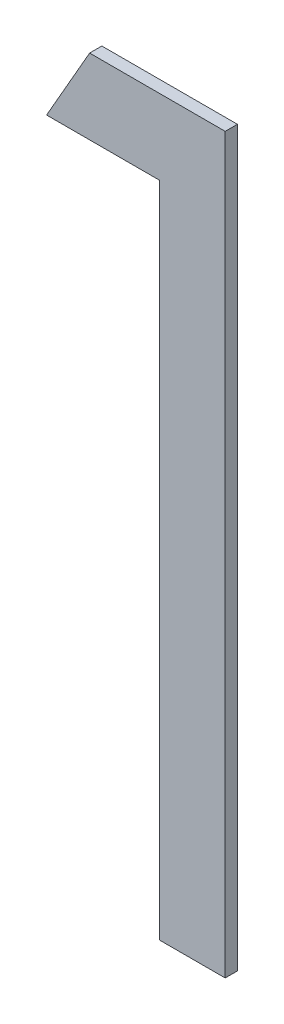
ISO-10303-21;
HEADER;
FILE_DESCRIPTION(('STEP AP214'),'2;1');
FILE_NAME('part.step','',(''),(''),'','','');
FILE_SCHEMA(('AUTOMOTIVE_DESIGN { 1 0 10303 214 1 1 1 1 }'));
ENDSEC;
DATA;
#1=APPLICATION_CONTEXT('core data for automotive mechanical design processes');
#2=APPLICATION_PROTOCOL_DEFINITION('international standard','automotive_design',2000,#1);
#3=PRODUCT_CONTEXT('',#1,'mechanical');
#4=PRODUCT('Part','Part','',(#3));
#5=PRODUCT_RELATED_PRODUCT_CATEGORY('part','',(#4));
#6=PRODUCT_DEFINITION_FORMATION('','',#4);
#7=PRODUCT_DEFINITION_CONTEXT('part definition',#1,'design');
#8=PRODUCT_DEFINITION('design','',#6,#7);
#9=PRODUCT_DEFINITION_SHAPE('','',#8);
#10=(LENGTH_UNIT() NAMED_UNIT(*) SI_UNIT(.MILLI.,.METRE.));
#11=(NAMED_UNIT(*) PLANE_ANGLE_UNIT() SI_UNIT($,.RADIAN.));
#12=(NAMED_UNIT(*) SI_UNIT($,.STERADIAN.) SOLID_ANGLE_UNIT());
#13=UNCERTAINTY_MEASURE_WITH_UNIT(LENGTH_MEASURE(1.E-05),#10,'distance_accuracy_value','');
#14=(GEOMETRIC_REPRESENTATION_CONTEXT(3) GLOBAL_UNCERTAINTY_ASSIGNED_CONTEXT((#13)) GLOBAL_UNIT_ASSIGNED_CONTEXT((#10,
#11,#12)) REPRESENTATION_CONTEXT('',''));
#15=CARTESIAN_POINT('',(0.,0.,0.));
#16=DIRECTION('',(0.,0.,1.));
#17=DIRECTION('',(1.,0.,0.));
#18=AXIS2_PLACEMENT_3D('',#15,#16,#17);
#19=CARTESIAN_POINT('',(0.361363980490763,1.06273011000654,0.551));
#20=DIRECTION('',(-0.867930013859703,0.496686511837693,0.));
#21=DIRECTION('',(-0.496686511837693,-0.867930013859703,0.));
#22=AXIS2_PLACEMENT_3D('',#19,#20,#21);
#23=PLANE('',#22);
#24=DIRECTION('',(0.496686511837698,0.867930013859701,0.));
#25=VECTOR('',#24,1.);
#26=CARTESIAN_POINT('',(0.361363980490763,1.06273011000654,0.55));
#27=LINE('',#26,#25);
#28=CARTESIAN_POINT('',(0.361363980490763,1.06273011000654,0.55));
#29=VERTEX_POINT('',#28);
#30=CARTESIAN_POINT('',(0.364885615106147,1.06888395616039,0.55));
#31=VERTEX_POINT('',#30);
#32=EDGE_CURVE('E11',#29,#31,#27,.T.);
#33=ORIENTED_EDGE('',*,*,#32,.F.);
#34=DIRECTION('',(0.,-2.22044604925006E-13,-1.));
#35=VECTOR('',#34,1.);
#36=CARTESIAN_POINT('',(0.361363980490763,1.06273011000654,0.551));
#37=LINE('',#36,#35);
#38=CARTESIAN_POINT('',(0.361363980490763,1.06273011000654,0.551));
#39=VERTEX_POINT('',#38);
#40=EDGE_CURVE('E119',#39,#29,#37,.T.);
#41=ORIENTED_EDGE('',*,*,#40,.F.);
#42=DIRECTION('',(0.496686511837698,0.867930013859701,0.));
#43=VECTOR('',#42,1.);
#44=CARTESIAN_POINT('',(0.361363980490763,1.06273011000654,0.551));
#45=LINE('',#44,#43);
#46=CARTESIAN_POINT('',(0.364885615106147,1.06888395616039,0.551));
#47=VERTEX_POINT('',#46);
#48=EDGE_CURVE('E112',#39,#47,#45,.T.);
#49=ORIENTED_EDGE('',*,*,#48,.T.);
#50=DIRECTION('',(0.,0.,-1.));
#51=VECTOR('',#50,1.);
#52=CARTESIAN_POINT('',(0.364885615106147,1.06888395616039,0.551));
#53=LINE('',#52,#51);
#54=EDGE_CURVE('E85',#47,#31,#53,.T.);
#55=ORIENTED_EDGE('',*,*,#54,.T.);
#56=EDGE_LOOP('',(#33,#41,#49,#55));
#57=FACE_BOUND('',#56,.T.);
#58=ADVANCED_FACE('F17',(#57),#23,.T.);
#59=CARTESIAN_POINT('',(0.370594749721532,1.06273011000654,0.551));
#60=DIRECTION('',(0.,-1.,0.));
#61=DIRECTION('',(0.,0.,-1.));
#62=AXIS2_PLACEMENT_3D('',#59,#60,#61);
#63=PLANE('',#62);
#64=DIRECTION('',(-1.,0.,0.));
#65=VECTOR('',#64,1.);
#66=CARTESIAN_POINT('',(0.370594749721532,1.06273011000654,0.55));
#67=LINE('',#66,#65);
#68=CARTESIAN_POINT('',(0.370594749721532,1.06273011000654,0.55));
#69=VERTEX_POINT('',#68);
#70=EDGE_CURVE('E24',#69,#29,#67,.T.);
#71=ORIENTED_EDGE('',*,*,#70,.F.);
#72=DIRECTION('',(0.,-2.22044604925006E-13,-1.));
#73=VECTOR('',#72,1.);
#74=CARTESIAN_POINT('',(0.370594749721532,1.06273011000654,0.551));
#75=LINE('',#74,#73);
#76=CARTESIAN_POINT('',(0.370594749721532,1.06273011000654,0.551));
#77=VERTEX_POINT('',#76);
#78=EDGE_CURVE('E114',#77,#69,#75,.T.);
#79=ORIENTED_EDGE('',*,*,#78,.F.);
#80=DIRECTION('',(-1.,0.,0.));
#81=VECTOR('',#80,1.);
#82=CARTESIAN_POINT('',(0.370594749721532,1.06273011000654,0.551));
#83=LINE('',#82,#81);
#84=EDGE_CURVE('E103',#77,#39,#83,.T.);
#85=ORIENTED_EDGE('',*,*,#84,.T.);
#86=ORIENTED_EDGE('',*,*,#40,.T.);
#87=EDGE_LOOP('',(#71,#79,#85,#86));
#88=FACE_BOUND('',#87,.T.);
#89=ADVANCED_FACE('F127',(#88),#63,.T.);
#90=CARTESIAN_POINT('',(0.370594749721532,1.00888395616039,0.551));
#91=DIRECTION('',(-1.,0.,0.));
#92=DIRECTION('',(0.,0.,1.));
#93=AXIS2_PLACEMENT_3D('',#90,#91,#92);
#94=PLANE('',#93);
#95=DIRECTION('',(0.,1.,0.));
#96=VECTOR('',#95,1.);
#97=CARTESIAN_POINT('',(0.370594749721532,1.00888395616039,0.55));
#98=LINE('',#97,#96);
#99=CARTESIAN_POINT('',(0.370594749721532,1.00888395616039,0.55));
#100=VERTEX_POINT('',#99);
#101=EDGE_CURVE('E116',#100,#69,#98,.T.);
#102=ORIENTED_EDGE('',*,*,#101,.F.);
#103=DIRECTION('',(0.,0.,-1.));
#104=VECTOR('',#103,1.);
#105=CARTESIAN_POINT('',(0.370594749721532,1.00888395616039,0.551));
#106=LINE('',#105,#104);
#107=CARTESIAN_POINT('',(0.370594749721532,1.00888395616039,0.551));
#108=VERTEX_POINT('',#107);
#109=EDGE_CURVE('E106',#108,#100,#106,.T.);
#110=ORIENTED_EDGE('',*,*,#109,.F.);
#111=DIRECTION('',(0.,1.,0.));
#112=VECTOR('',#111,1.);
#113=CARTESIAN_POINT('',(0.370594749721532,1.00888395616039,0.551));
#114=LINE('',#113,#112);
#115=EDGE_CURVE('E96',#108,#77,#114,.T.);
#116=ORIENTED_EDGE('',*,*,#115,.T.);
#117=ORIENTED_EDGE('',*,*,#78,.T.);
#118=EDGE_LOOP('',(#102,#110,#116,#117));
#119=FACE_BOUND('',#118,.T.);
#120=ADVANCED_FACE('F123',(#119),#94,.T.);
#121=CARTESIAN_POINT('',(0.375979365106147,1.00888395616039,0.551));
#122=DIRECTION('',(0.,-1.,0.));
#123=DIRECTION('',(0.,0.,-1.));
#124=AXIS2_PLACEMENT_3D('',#121,#122,#123);
#125=PLANE('',#124);
#126=DIRECTION('',(-1.,0.,0.));
#127=VECTOR('',#126,1.);
#128=CARTESIAN_POINT('',(0.375979365106147,1.00888395616039,0.55));
#129=LINE('',#128,#127);
#130=CARTESIAN_POINT('',(0.375979365106147,1.00888395616039,0.55));
#131=VERTEX_POINT('',#130);
#132=EDGE_CURVE('E109',#131,#100,#129,.T.);
#133=ORIENTED_EDGE('',*,*,#132,.F.);
#134=DIRECTION('',(0.,0.,-1.));
#135=VECTOR('',#134,1.);
#136=CARTESIAN_POINT('',(0.375979365106147,1.00888395616039,0.551));
#137=LINE('',#136,#135);
#138=CARTESIAN_POINT('',(0.375979365106147,1.00888395616039,0.551));
#139=VERTEX_POINT('',#138);
#140=EDGE_CURVE('E99',#139,#131,#137,.T.);
#141=ORIENTED_EDGE('',*,*,#140,.F.);
#142=DIRECTION('',(-1.,0.,0.));
#143=VECTOR('',#142,1.);
#144=CARTESIAN_POINT('',(0.375979365106147,1.00888395616039,0.551));
#145=LINE('',#144,#143);
#146=EDGE_CURVE('E79',#139,#108,#145,.T.);
#147=ORIENTED_EDGE('',*,*,#146,.T.);
#148=ORIENTED_EDGE('',*,*,#109,.T.);
#149=EDGE_LOOP('',(#133,#141,#147,#148));
#150=FACE_BOUND('',#149,.T.);
#151=ADVANCED_FACE('F125',(#150),#125,.T.);
#152=CARTESIAN_POINT('',(0.375979365106147,1.06888395616039,0.551));
#153=DIRECTION('',(1.,0.,0.));
#154=DIRECTION('',(0.,0.,-1.));
#155=AXIS2_PLACEMENT_3D('',#152,#153,#154);
#156=PLANE('',#155);
#157=DIRECTION('',(0.,-1.,0.));
#158=VECTOR('',#157,1.);
#159=CARTESIAN_POINT('',(0.375979365106147,1.06888395616039,0.55));
#160=LINE('',#159,#158);
#161=CARTESIAN_POINT('',(0.375979365106147,1.06888395616039,0.55));
#162=VERTEX_POINT('',#161);
#163=EDGE_CURVE('E74',#162,#131,#160,.T.);
#164=ORIENTED_EDGE('',*,*,#163,.F.);
#165=DIRECTION('',(0.,0.,-1.));
#166=VECTOR('',#165,1.);
#167=CARTESIAN_POINT('',(0.375979365106147,1.06888395616039,0.551));
#168=LINE('',#167,#166);
#169=CARTESIAN_POINT('',(0.375979365106147,1.06888395616039,0.551));
#170=VERTEX_POINT('',#169);
#171=EDGE_CURVE('E66',#170,#162,#168,.T.);
#172=ORIENTED_EDGE('',*,*,#171,.F.);
#173=DIRECTION('',(0.,-1.,0.));
#174=VECTOR('',#173,1.);
#175=CARTESIAN_POINT('',(0.375979365106147,1.06888395616039,0.551));
#176=LINE('',#175,#174);
#177=EDGE_CURVE('E71',#170,#139,#176,.T.);
#178=ORIENTED_EDGE('',*,*,#177,.T.);
#179=ORIENTED_EDGE('',*,*,#140,.T.);
#180=EDGE_LOOP('',(#164,#172,#178,#179));
#181=FACE_BOUND('',#180,.T.);
#182=ADVANCED_FACE('F68',(#181),#156,.T.);
#183=CARTESIAN_POINT('',(0.364885615106147,1.06888395616039,0.551));
#184=DIRECTION('',(0.,1.,0.));
#185=DIRECTION('',(0.,0.,1.));
#186=AXIS2_PLACEMENT_3D('',#183,#184,#185);
#187=PLANE('',#186);
#188=DIRECTION('',(1.,0.,0.));
#189=VECTOR('',#188,1.);
#190=CARTESIAN_POINT('',(0.364885615106147,1.06888395616039,0.55));
#191=LINE('',#190,#189);
#192=EDGE_CURVE('E78',#31,#162,#191,.T.);
#193=ORIENTED_EDGE('',*,*,#192,.F.);
#194=ORIENTED_EDGE('',*,*,#54,.F.);
#195=DIRECTION('',(1.,0.,0.));
#196=VECTOR('',#195,1.);
#197=CARTESIAN_POINT('',(0.364885615106147,1.06888395616039,0.551));
#198=LINE('',#197,#196);
#199=EDGE_CURVE('E83',#47,#170,#198,.T.);
#200=ORIENTED_EDGE('',*,*,#199,.T.);
#201=ORIENTED_EDGE('',*,*,#171,.T.);
#202=EDGE_LOOP('',(#193,#194,#200,#201));
#203=FACE_BOUND('',#202,.T.);
#204=ADVANCED_FACE('F84',(#203),#187,.T.);
#205=CARTESIAN_POINT('',(0.,0.,0.551));
#206=DIRECTION('',(0.,0.,-1.));
#207=DIRECTION('',(-1.,0.,0.));
#208=AXIS2_PLACEMENT_3D('',#205,#206,#207);
#209=PLANE('',#208);
#210=ORIENTED_EDGE('',*,*,#48,.F.);
#211=ORIENTED_EDGE('',*,*,#84,.F.);
#212=ORIENTED_EDGE('',*,*,#115,.F.);
#213=ORIENTED_EDGE('',*,*,#146,.F.);
#214=ORIENTED_EDGE('',*,*,#177,.F.);
#215=ORIENTED_EDGE('',*,*,#199,.F.);
#216=EDGE_LOOP('',(#210,#211,#212,#213,#214,#215));
#217=FACE_BOUND('',#216,.T.);
#218=ADVANCED_FACE('F89',(#217),#209,.F.);
#219=CARTESIAN_POINT('',(0.,0.,0.55));
#220=DIRECTION('',(0.,0.,-1.));
#221=DIRECTION('',(-1.,0.,0.));
#222=AXIS2_PLACEMENT_3D('',#219,#220,#221);
#223=PLANE('',#222);
#224=ORIENTED_EDGE('',*,*,#32,.T.);
#225=ORIENTED_EDGE('',*,*,#192,.T.);
#226=ORIENTED_EDGE('',*,*,#163,.T.);
#227=ORIENTED_EDGE('',*,*,#132,.T.);
#228=ORIENTED_EDGE('',*,*,#101,.T.);
#229=ORIENTED_EDGE('',*,*,#70,.T.);
#230=EDGE_LOOP('',(#224,#225,#226,#227,#228,#229));
#231=FACE_BOUND('',#230,.T.);
#232=ADVANCED_FACE('F121',(#231),#223,.T.);
#233=CLOSED_SHELL('',(#58,#89,#120,#151,#182,#204,#218,#232));
#234=MANIFOLD_SOLID_BREP('B1',#233);
#235=ADVANCED_BREP_SHAPE_REPRESENTATION('',(#18,#234),#14);
#236=SHAPE_DEFINITION_REPRESENTATION(#9,#235);
ENDSEC;
END-ISO-10303-21;
